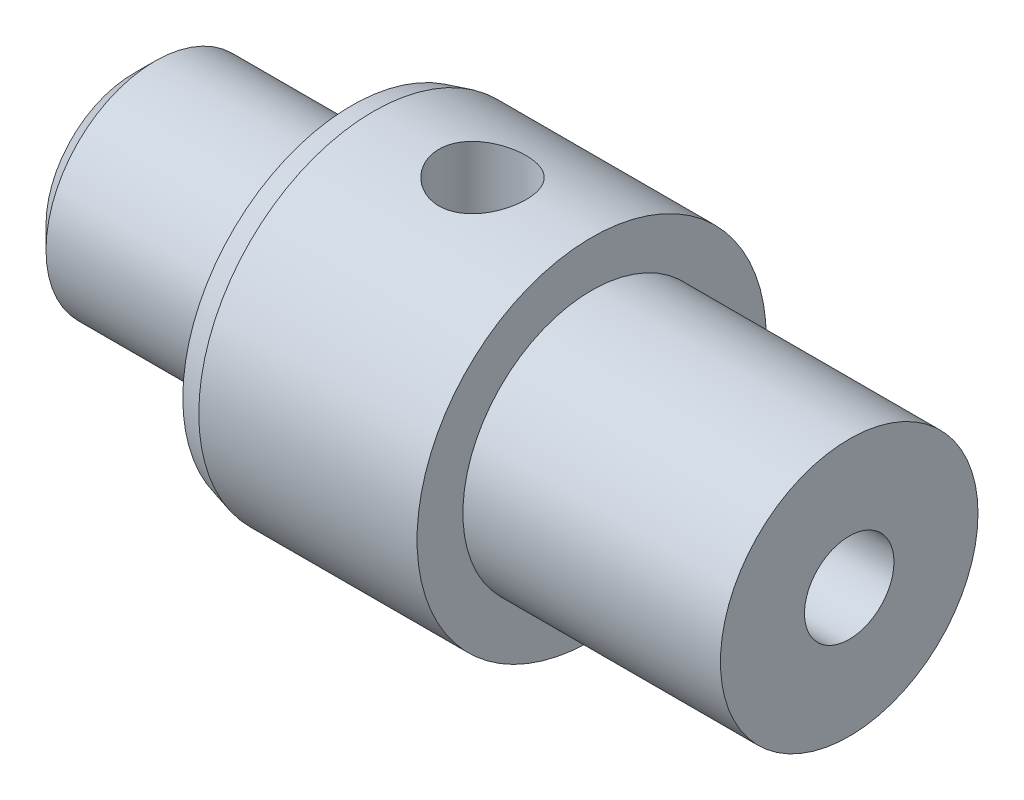
ISO-10303-21;
HEADER;
FILE_DESCRIPTION(('STEP AP214'),'2;1');
FILE_NAME('part.step','',(''),(''),'','','');
FILE_SCHEMA(('AUTOMOTIVE_DESIGN { 1 0 10303 214 1 1 1 1 }'));
ENDSEC;
DATA;
#1=APPLICATION_CONTEXT('core data for automotive mechanical design processes');
#2=APPLICATION_PROTOCOL_DEFINITION('international standard','automotive_design',2000,#1);
#3=PRODUCT_CONTEXT('',#1,'mechanical');
#4=PRODUCT('Part','Part','',(#3));
#5=PRODUCT_RELATED_PRODUCT_CATEGORY('part','',(#4));
#6=PRODUCT_DEFINITION_FORMATION('','',#4);
#7=PRODUCT_DEFINITION_CONTEXT('part definition',#1,'design');
#8=PRODUCT_DEFINITION('design','',#6,#7);
#9=PRODUCT_DEFINITION_SHAPE('','',#8);
#10=(LENGTH_UNIT() NAMED_UNIT(*) SI_UNIT(.MILLI.,.METRE.));
#11=(NAMED_UNIT(*) PLANE_ANGLE_UNIT() SI_UNIT($,.RADIAN.));
#12=(NAMED_UNIT(*) SI_UNIT($,.STERADIAN.) SOLID_ANGLE_UNIT());
#13=UNCERTAINTY_MEASURE_WITH_UNIT(LENGTH_MEASURE(1.E-05),#10,'distance_accuracy_value','');
#14=(GEOMETRIC_REPRESENTATION_CONTEXT(3) GLOBAL_UNCERTAINTY_ASSIGNED_CONTEXT((#13)) GLOBAL_UNIT_ASSIGNED_CONTEXT((#10,
#11,#12)) REPRESENTATION_CONTEXT('',''));
#15=CARTESIAN_POINT('',(0.,0.,0.));
#16=DIRECTION('',(0.,0.,1.));
#17=DIRECTION('',(1.,0.,0.));
#18=AXIS2_PLACEMENT_3D('',#15,#16,#17);
#19=CARTESIAN_POINT('',(10.5,0.,0.));
#20=DIRECTION('',(1.,0.,0.));
#21=DIRECTION('',(0.,0.,-1.));
#22=AXIS2_PLACEMENT_3D('',#19,#20,#21);
#23=PLANE('',#22);
#24=CARTESIAN_POINT('',(10.5,0.,0.));
#25=DIRECTION('',(1.,0.,0.));
#26=DIRECTION('',(0.,0.,-1.));
#27=AXIS2_PLACEMENT_3D('',#24,#25,#26);
#28=CIRCLE('',#27,4.);
#29=CARTESIAN_POINT('',(10.5,0.,-4.));
#30=VERTEX_POINT('',#29);
#31=EDGE_CURVE('E69',#30,#30,#28,.T.);
#32=ORIENTED_EDGE('',*,*,#31,.T.);
#33=EDGE_LOOP('',(#32));
#34=FACE_BOUND('',#33,.T.);
#35=CARTESIAN_POINT('',(10.5,0.,0.));
#36=DIRECTION('',(1.,0.,0.));
#37=DIRECTION('',(0.,0.,-1.));
#38=AXIS2_PLACEMENT_3D('',#35,#36,#37);
#39=CIRCLE('',#38,2.95);
#40=CARTESIAN_POINT('',(10.5,0.,-2.95));
#41=VERTEX_POINT('',#40);
#42=EDGE_CURVE('E55',#41,#41,#39,.T.);
#43=ORIENTED_EDGE('',*,*,#42,.F.);
#44=EDGE_LOOP('',(#43));
#45=FACE_BOUND('',#44,.T.);
#46=ADVANCED_FACE('F35',(#34,#45),#23,.T.);
#47=CARTESIAN_POINT('',(5.,4.,0.));
#48=DIRECTION('',(-1.,0.,0.));
#49=DIRECTION('',(0.,0.,1.));
#50=AXIS2_PLACEMENT_3D('',#47,#48,#49);
#51=PLANE('',#50);
#52=CARTESIAN_POINT('',(5.,0.,0.));
#53=DIRECTION('',(-1.,0.,0.));
#54=DIRECTION('',(0.,0.,1.));
#55=AXIS2_PLACEMENT_3D('',#52,#53,#54);
#56=CIRCLE('',#55,3.86602540400003);
#57=CARTESIAN_POINT('',(5.,0.,3.86602540400003));
#58=VERTEX_POINT('',#57);
#59=EDGE_CURVE('E11',#58,#58,#56,.T.);
#60=ORIENTED_EDGE('',*,*,#59,.T.);
#61=EDGE_LOOP('',(#60));
#62=FACE_BOUND('',#61,.T.);
#63=CARTESIAN_POINT('',(5.,0.,0.));
#64=DIRECTION('',(-1.,0.,0.));
#65=DIRECTION('',(0.,0.,1.));
#66=AXIS2_PLACEMENT_3D('',#63,#64,#65);
#67=CIRCLE('',#66,2.5);
#68=CARTESIAN_POINT('',(5.,0.,2.5));
#69=VERTEX_POINT('',#68);
#70=EDGE_CURVE('E65',#69,#69,#67,.T.);
#71=ORIENTED_EDGE('',*,*,#70,.F.);
#72=EDGE_LOOP('',(#71));
#73=FACE_BOUND('',#72,.T.);
#74=ADVANCED_FACE('F109',(#62,#73),#51,.T.);
#75=CARTESIAN_POINT('',(5.,0.,0.));
#76=DIRECTION('',(1.,0.,0.));
#77=DIRECTION('',(0.,0.,-1.));
#78=AXIS2_PLACEMENT_3D('',#75,#76,#77);
#79=CYLINDRICAL_SURFACE('',#78,4.);
#80=CARTESIAN_POINT('',(5.49999999999986,0.,0.));
#81=DIRECTION('',(-1.,0.,0.));
#82=DIRECTION('',(0.,0.,1.));
#83=AXIS2_PLACEMENT_3D('',#80,#81,#82);
#84=CIRCLE('',#83,4.);
#85=CARTESIAN_POINT('',(5.49999999999986,0.,4.));
#86=VERTEX_POINT('',#85);
#87=EDGE_CURVE('E42',#86,#86,#84,.F.);
#88=ORIENTED_EDGE('',*,*,#87,.T.);
#89=EDGE_LOOP('',(#88));
#90=FACE_BOUND('',#89,.T.);
#91=CARTESIAN_POINT('',(8.99999999999999,4.00000000000001,0.));
#92=CARTESIAN_POINT('',(8.99999844950788,3.99999906578676,-0.05525072577982));
#93=CARTESIAN_POINT('',(8.99540563281746,3.99884385421219,-0.110518771887174));
#94=CARTESIAN_POINT('',(8.97718323246199,3.99434742553261,-0.219470882513686));
#95=CARTESIAN_POINT('',(8.96354852697476,3.99100496946646,-0.273154031247156));
#96=CARTESIAN_POINT('',(8.9277071643586,3.98250417554693,-0.377347248121714));
#97=CARTESIAN_POINT('',(8.90551080085647,3.97734801894725,-0.427861042286664));
#98=CARTESIAN_POINT('',(8.85321240663677,3.96576895871729,-0.524448087936278));
#99=CARTESIAN_POINT('',(8.82311010925403,3.95934601236034,-0.570521189565833));
#100=CARTESIAN_POINT('',(8.75519947356385,3.94578275727868,-0.657867951533939));
#101=CARTESIAN_POINT('',(8.7172589500272,3.93863138099022,-0.699037126707374));
#102=CARTESIAN_POINT('',(8.63503186339405,3.92449080078353,-0.774499284802194));
#103=CARTESIAN_POINT('',(8.59074458470233,3.91750161525566,-0.808791491299414));
#104=CARTESIAN_POINT('',(8.4962698488417,3.9043651713314,-0.870017695199344));
#105=CARTESIAN_POINT('',(8.44600451279306,3.89823196313737,-0.896834810616894));
#106=CARTESIAN_POINT('',(8.34150105889442,3.88766329874816,-0.941597939033674));
#107=CARTESIAN_POINT('',(8.28726357778282,3.88322757115193,-0.959545370292877));
#108=CARTESIAN_POINT('',(8.17750433453168,3.87666984478368,-0.985703224536181));
#109=CARTESIAN_POINT('',(8.12203006930013,3.87450327383618,-0.994101512222213));
#110=CARTESIAN_POINT('',(8.01042095399068,3.87259575025161,-1.00150785004522));
#111=CARTESIAN_POINT('',(7.95428621286759,3.87285440299096,-1.00051742787864));
#112=CARTESIAN_POINT('',(7.84438946150368,3.87572803664412,-0.989324349759508));
#113=CARTESIAN_POINT('',(7.79060291902327,3.87828575334586,-0.979345560127001));
#114=CARTESIAN_POINT('',(7.68549263272581,3.88537806450989,-0.950816124602059));
#115=CARTESIAN_POINT('',(7.63416906464735,3.88991279980464,-0.932264868046271));
#116=CARTESIAN_POINT('',(7.53484132249863,3.90050075936125,-0.886926318624759));
#117=CARTESIAN_POINT('',(7.48687588547364,3.90656884979614,-0.860057778155264));
#118=CARTESIAN_POINT('',(7.39605419349545,3.91953140564258,-0.79890418400996));
#119=CARTESIAN_POINT('',(7.35319883462184,3.9264260155649,-0.764617832539216));
#120=CARTESIAN_POINT('',(7.27253092287041,3.94050587026521,-0.688442283120803));
#121=CARTESIAN_POINT('',(7.23489700662578,3.94769379651981,-0.646364172110565));
#122=CARTESIAN_POINT('',(7.16718583835741,3.96137310385857,-0.556407945002459));
#123=CARTESIAN_POINT('',(7.13710881715763,3.96786446366277,-0.508529651805289));
#124=CARTESIAN_POINT('',(7.08529960918375,3.97945154729455,-0.408077259120922));
#125=CARTESIAN_POINT('',(7.06359643983039,3.9845424008515,-0.355487595472411));
#126=CARTESIAN_POINT('',(7.0293884628603,3.99271944660946,-0.247250672095252));
#127=CARTESIAN_POINT('',(7.01688189572125,3.99580602226187,-0.191603999433654));
#128=CARTESIAN_POINT('',(7.00169495629412,3.9995699951425,-0.0803599802600163));
#129=CARTESIAN_POINT('',(6.99877131594981,4.00030702338852,-0.0247978133254723));
#130=CARTESIAN_POINT('',(7.00216600137034,3.999458698763,0.0860219165343384));
#131=CARTESIAN_POINT('',(7.00848349519943,3.99787355494564,0.141279506429729));
#132=CARTESIAN_POINT('',(7.02998060559427,3.99259720751571,0.249076179184326));
#133=CARTESIAN_POINT('',(7.04502750898467,3.98893756123874,0.301643412645834));
#134=CARTESIAN_POINT('',(7.08340472268564,3.97992471089423,0.403504861635004));
#135=CARTESIAN_POINT('',(7.10673586954212,3.97457133579928,0.452798746021752));
#136=CARTESIAN_POINT('',(7.16149075258316,3.96262205284207,0.547682089619893));
#137=CARTESIAN_POINT('',(7.19305074159785,3.95600578244621,0.593190294557214));
#138=CARTESIAN_POINT('',(7.26319327253132,3.94229672791613,0.678351075762156));
#139=CARTESIAN_POINT('',(7.30177702641128,3.93520386167803,0.718002639315331));
#140=CARTESIAN_POINT('',(7.38600130722965,3.92112637973848,0.791327045381811));
#141=CARTESIAN_POINT('',(7.43179180200162,3.91414869458187,0.824829245081345));
#142=CARTESIAN_POINT('',(7.52848842297715,3.90128585584826,0.883673839341788));
#143=CARTESIAN_POINT('',(7.57939432197317,3.89540065378018,0.90901659610528));
#144=CARTESIAN_POINT('',(7.68460381494206,3.88545396489777,0.950634280406184));
#145=CARTESIAN_POINT('',(7.73888508556268,3.88138170194604,0.966962931102699));
#146=CARTESIAN_POINT('',(7.84953975859274,3.87551162726789,0.990230439969174));
#147=CARTESIAN_POINT('',(7.90591270068833,3.87371331813291,0.997171351652426));
#148=CARTESIAN_POINT('',(8.01741401590347,3.87263267469305,1.00135906022265));
#149=CARTESIAN_POINT('',(8.07253162341649,3.87327955152176,0.998878598520066));
#150=CARTESIAN_POINT('',(8.18153592577865,3.87685272671895,0.984918185541899));
#151=CARTESIAN_POINT('',(8.23542264534243,3.87977897927905,0.973438415124501));
#152=CARTESIAN_POINT('',(8.34013897271027,3.88754173788482,0.941954212961851));
#153=CARTESIAN_POINT('',(8.39098487016013,3.89236676824206,0.922000936453572));
#154=CARTESIAN_POINT('',(8.48864358847579,3.90338503816553,0.874176609070036));
#155=CARTESIAN_POINT('',(8.53545584879127,3.90957846747182,0.846304460022782));
#156=CARTESIAN_POINT('',(8.62503641933467,3.92283756175675,0.782578499091414));
#157=CARTESIAN_POINT('',(8.66766738228263,3.92992176554505,0.746535441941493));
#158=CARTESIAN_POINT('',(8.74636469653026,3.94405351497524,0.667859580793147));
#159=CARTESIAN_POINT('',(8.78242948674197,3.95110105151373,0.625225214174087));
#160=CARTESIAN_POINT('',(8.84760753904306,3.96451770431775,0.533645057801718));
#161=CARTESIAN_POINT('',(8.87658307578104,3.97087222243912,0.484598948210916));
#162=CARTESIAN_POINT('',(8.92583164196034,3.98203283316746,0.382177373006978));
#163=CARTESIAN_POINT('',(8.94611090709901,3.98684003466521,0.328805042291154));
#164=CARTESIAN_POINT('',(8.97438122021976,3.99365373043694,0.229606835495643));
#165=CARTESIAN_POINT('',(8.98396749536894,3.9960172336846,0.184253447272042));
#166=CARTESIAN_POINT('',(8.99677729574795,3.99919070154632,0.0926040476908534));
#167=CARTESIAN_POINT('',(9.00000129953686,4.00000078300597,0.0463081074950765));
#168=CARTESIAN_POINT('',(8.99999999999999,4.00000000000001,0.));
#169=B_SPLINE_CURVE_WITH_KNOTS('',3,(#91,#92,#93,#94,#95,#96,#97,#98,#99,#100,#101,#102,#103,
#104,#105,#106,#107,#108,#109,#110,#111,#112,#113,#114,#115,#116,#117,#118,#119,#120,#121,#122,
#123,#124,#125,#126,#127,#128,#129,#130,#131,#132,#133,#134,#135,#136,#137,#138,#139,#140,#141,
#142,#143,#144,#145,#146,#147,#148,#149,#150,#151,#152,#153,#154,#155,#156,#157,#158,#159,#160,
#161,#162,#163,#164,#165,#166,#167,#168),.UNSPECIFIED.,.T.,.F.,(4,2,2,2,2,2,2,2,2,2,2,2,2,2,2,2,
2,2,2,2,2,2,2,2,2,2,2,2,2,2,2,2,2,2,2,2,2,2,4),(0.,0.165582474981258,0.331258825175929,
0.496736601524066,0.662219960112878,0.830762902914251,0.999324863867068,1.1703909836387,
1.34142974112911,1.50904196732952,1.67662692075129,1.84014998004677,2.00368468977357,
2.16887018582583,2.33408460557439,2.5040100064601,2.67394059705495,2.84445486006073,
3.01493649125758,3.18105539299514,3.34715934075158,3.51080183009354,3.67446084881523,
3.8410239171023,4.00761575338674,4.17829672802979,4.34897012499667,4.51861503076019,
4.68822282168266,4.85295853599069,5.01769093970683,5.18144267039625,5.34521712091261,
5.51326384273267,5.68135046513605,5.85248123666385,6.02348909214226,6.16228161961425,
6.30106370695352),.UNSPECIFIED.);
#170=CARTESIAN_POINT('',(8.99999999999999,4.00000000000001,0.));
#171=VERTEX_POINT('',#170);
#172=EDGE_CURVE('E79',#171,#171,#169,.T.);
#173=ORIENTED_EDGE('',*,*,#172,.F.);
#174=EDGE_LOOP('',(#173));
#175=FACE_BOUND('',#174,.T.);
#176=CARTESIAN_POINT('',(8.,-3.87298334620742,-0.999999999999988));
#177=CARTESIAN_POINT('',(8.05522030035679,-3.87298440057185,-0.999998431438687));
#178=CARTESIAN_POINT('',(8.11045795943136,-3.87417722499279,-0.995410498208057));
#179=CARTESIAN_POINT('',(8.21934703123261,-3.87880744892249,-0.977209250194434));
#180=CARTESIAN_POINT('',(8.27299750177996,-3.88224615474181,-0.963590682698065));
#181=CARTESIAN_POINT('',(8.37712141528784,-3.89095489813012,-0.927796479849623));
#182=CARTESIAN_POINT('',(8.42759886215775,-3.8962225706936,-0.905631891140932));
#183=CARTESIAN_POINT('',(8.52412434101247,-3.90799276818327,-0.853408456505396));
#184=CARTESIAN_POINT('',(8.57017218483114,-3.91449534553241,-0.823349275424494));
#185=CARTESIAN_POINT('',(8.65754465810584,-3.92816286540368,-0.755483370924507));
#186=CARTESIAN_POINT('',(8.69875744014027,-3.93533839048709,-0.717534755081548));
#187=CARTESIAN_POINT('',(8.77430455774387,-3.94945150206622,-0.63527282564032));
#188=CARTESIAN_POINT('',(8.80863825024862,-3.95638906626692,-0.590958917672131));
#189=CARTESIAN_POINT('',(8.86991018705257,-3.96936166208095,-0.496458080431557));
#190=CARTESIAN_POINT('',(8.89673855526459,-3.975382749602,-0.446197830478036));
#191=CARTESIAN_POINT('',(8.9415238576612,-3.9857232477043,-0.341705273717104));
#192=CARTESIAN_POINT('',(8.95948210076619,-3.99004290933747,-0.287473554316773));
#193=CARTESIAN_POINT('',(8.98565913383143,-3.99641903539262,-0.17774350350166));
#194=CARTESIAN_POINT('',(8.99406785773062,-3.99851957537723,-0.122293087819587));
#195=CARTESIAN_POINT('',(9.00150335171021,-4.00037437642922,-0.0107315277051063));
#196=CARTESIAN_POINT('',(9.00053150888383,-4.00012898438682,0.0453795178152285));
#197=CARTESIAN_POINT('',(8.98937005989993,-3.99735237981413,0.155352247172387));
#198=CARTESIAN_POINT('',(8.97938546997845,-3.99487200936349,0.209236215601067));
#199=CARTESIAN_POINT('',(8.95081149198059,-3.98796334609942,0.314538247413685));
#200=CARTESIAN_POINT('',(8.93222164584902,-3.98353494959376,0.365956179370436));
#201=CARTESIAN_POINT('',(8.88679897172516,-3.97315003880358,0.465406703501803));
#202=CARTESIAN_POINT('',(8.85989318213529,-3.96718007878021,0.5134045097665));
#203=CARTESIAN_POINT('',(8.79865772835349,-3.9543596152386,0.604275622340483));
#204=CARTESIAN_POINT('',(8.76432677257574,-3.94750895860996,0.647148035085499));
#205=CARTESIAN_POINT('',(8.68811650320704,-3.93345485507808,0.727774035084949));
#206=CARTESIAN_POINT('',(8.64605804306088,-3.92624687810367,0.765357679075191));
#207=CARTESIAN_POINT('',(8.55616001058389,-3.91246017406683,0.83297637596301));
#208=CARTESIAN_POINT('',(8.50832016820359,-3.90588147642388,0.863011076046007));
#209=CARTESIAN_POINT('',(8.40788398634041,-3.8940819873266,0.914788129022588));
#210=CARTESIAN_POINT('',(8.35526570787472,-3.88886793490289,0.93648956697048));
#211=CARTESIAN_POINT('',(8.24696581276941,-3.88047456055983,0.970685620636329));
#212=CARTESIAN_POINT('',(8.19128485440674,-3.87729480324088,0.983182206552898));
#213=CARTESIAN_POINT('',(8.08001619939075,-3.87342142415657,0.998331855466059));
#214=CARTESIAN_POINT('',(8.02446488266814,-3.8726643563746,1.00123618956784));
#215=CARTESIAN_POINT('',(7.91367122536873,-3.87354937392416,0.997806796206206));
#216=CARTESIAN_POINT('',(7.8584288568195,-3.87519123840507,0.991473919139507));
#217=CARTESIAN_POINT('',(7.75075429401812,-3.88062832781824,0.969970185575052));
#218=CARTESIAN_POINT('',(7.69829090937166,-3.8843878809375,0.954945627312686));
#219=CARTESIAN_POINT('',(7.59662741685933,-3.89360287308385,0.916647232668236));
#220=CARTESIAN_POINT('',(7.54742769637787,-3.89905851299446,0.893372419085006));
#221=CARTESIAN_POINT('',(7.45262348885306,-3.91118454837305,0.838708267174611));
#222=CARTESIAN_POINT('',(7.40710846398276,-3.91787667442657,0.80716870153424));
#223=CARTESIAN_POINT('',(7.32192465487947,-3.93166833228687,0.737060292934445));
#224=CARTESIAN_POINT('',(7.28225683333998,-3.93876793091388,0.698490294805429));
#225=CARTESIAN_POINT('',(7.20887558297162,-3.95278961212643,0.614262720984716));
#226=CARTESIAN_POINT('',(7.17533597498048,-3.95970280824734,0.568451952531583));
#227=CARTESIAN_POINT('',(7.11642565321951,-3.97238886645494,0.471702682694667));
#228=CARTESIAN_POINT('',(7.09105451335673,-3.97816178801584,0.420764448957584));
#229=CARTESIAN_POINT('',(7.04942158618884,-3.98788046295326,0.315558201731084));
#230=CARTESIAN_POINT('',(7.03309428624839,-3.99183932008964,0.261317381027876));
#231=CARTESIAN_POINT('',(7.00981586615664,-3.99754117358315,0.150749760318804));
#232=CARTESIAN_POINT('',(7.00286293650439,-3.99928459757363,0.09442336504124));
#233=CARTESIAN_POINT('',(6.99863241042448,-4.00034169408811,-0.0170835264433287));
#234=CARTESIAN_POINT('',(7.00109829090462,-3.99971978880008,-0.0722538269660348));
#235=CARTESIAN_POINT('',(7.01504782729434,-3.99625896457423,-0.18136749641474));
#236=CARTESIAN_POINT('',(7.02653121501312,-3.99342011157094,-0.235310901780886));
#237=CARTESIAN_POINT('',(7.05805221977094,-3.98585432853963,-0.340171035644814));
#238=CARTESIAN_POINT('',(7.07804345331464,-3.98113764502669,-0.391102494581017));
#239=CARTESIAN_POINT('',(7.12597057901934,-3.97031288913382,-0.488917053041465));
#240=CARTESIAN_POINT('',(7.15390747266958,-3.96420464137727,-0.535799641265047));
#241=CARTESIAN_POINT('',(7.21771523399708,-3.95107249681342,-0.625401928423895));
#242=CARTESIAN_POINT('',(7.25376014290738,-3.94403016945647,-0.667994988300581));
#243=CARTESIAN_POINT('',(7.33242285197382,-3.92990649053207,-0.746615020271245));
#244=CARTESIAN_POINT('',(7.37504231609795,-3.92282512952424,-0.78264032506817));
#245=CARTESIAN_POINT('',(7.4666014142013,-3.90927475860683,-0.847762026479231));
#246=CARTESIAN_POINT('',(7.51564412341249,-3.90281963730391,-0.876716619446584));
#247=CARTESIAN_POINT('',(7.61805548992285,-3.8914395555011,-0.925926896615611));
#248=CARTESIAN_POINT('',(7.67142096610729,-3.88651348244815,-0.946188909759546));
#249=CARTESIAN_POINT('',(7.77057701182628,-3.87951908741315,-0.97442252856556));
#250=CARTESIAN_POINT('',(7.81589316438236,-3.87708663005762,-0.983993170595817));
#251=CARTESIAN_POINT('',(7.90746886900147,-3.87381838580358,-0.996782292572807));
#252=CARTESIAN_POINT('',(7.95372834025063,-3.87298246270639,-1.00000131437051));
#253=CARTESIAN_POINT('',(8.,-3.87298334620742,-0.999999999999988));
#254=B_SPLINE_CURVE_WITH_KNOTS('',3,(#176,#177,#178,#179,#180,#181,#182,#183,#184,#185,#186,
#187,#188,#189,#190,#191,#192,#193,#194,#195,#196,#197,#198,#199,#200,#201,#202,#203,#204,#205,
#206,#207,#208,#209,#210,#211,#212,#213,#214,#215,#216,#217,#218,#219,#220,#221,#222,#223,#224,
#225,#226,#227,#228,#229,#230,#231,#232,#233,#234,#235,#236,#237,#238,#239,#240,#241,#242,#243,
#244,#245,#246,#247,#248,#249,#250,#251,#252,#253),.UNSPECIFIED.,.T.,.F.,(4,2,2,2,2,2,2,2,2,2,2,
2,2,2,2,2,2,2,2,2,2,2,2,2,2,2,2,2,2,2,2,2,2,2,2,2,2,2,4),(0.,0.165490976675229,
0.331078296534208,0.496452290829148,0.661833306984651,0.830495816734639,0.9991740858822,
1.17020598555441,1.3412126393511,1.50875500394411,1.67627259462681,1.84007305071851,
2.00388222686187,2.1691714969805,2.33448954183837,2.50428186625036,2.67408212476192,
2.84470572799632,3.0152928004809,3.18137429900958,3.34744050869791,3.51078961999953,
3.67415808564837,3.84073138339933,4.00733207550288,4.17810132382397,4.34886166284091,
4.51836829119041,4.68784219559884,4.85273378447251,5.01762046947061,5.18161950620153,
5.34563922291497,5.51358838629096,5.68158012622471,5.85270590910138,6.02370688542915,
6.16239130867199,6.30106390036075),.UNSPECIFIED.);
#255=CARTESIAN_POINT('',(8.,-3.87298334620742,-0.999999999999988));
#256=VERTEX_POINT('',#255);
#257=EDGE_CURVE('E72',#256,#256,#254,.T.);
#258=ORIENTED_EDGE('',*,*,#257,.F.);
#259=EDGE_LOOP('',(#258));
#260=FACE_BOUND('',#259,.T.);
#261=ORIENTED_EDGE('',*,*,#31,.F.);
#262=EDGE_LOOP('',(#261));
#263=FACE_BOUND('',#262,.T.);
#264=ADVANCED_FACE('F83',(#90,#175,#260,#263),#79,.T.);
#265=CARTESIAN_POINT('',(0.,0.,0.));
#266=DIRECTION('',(1.,0.,0.));
#267=DIRECTION('',(0.,0.,-1.));
#268=AXIS2_PLACEMENT_3D('',#265,#266,#267);
#269=CYLINDRICAL_SURFACE('',#268,2.5);
#270=CARTESIAN_POINT('',(0.500000000000072,0.,0.));
#271=DIRECTION('',(-1.,0.,0.));
#272=DIRECTION('',(0.,0.,1.));
#273=AXIS2_PLACEMENT_3D('',#270,#271,#272);
#274=CIRCLE('',#273,2.5);
#275=CARTESIAN_POINT('',(0.500000000000072,0.,2.5));
#276=VERTEX_POINT('',#275);
#277=EDGE_CURVE('E127',#276,#276,#274,.F.);
#278=ORIENTED_EDGE('',*,*,#277,.T.);
#279=EDGE_LOOP('',(#278));
#280=FACE_BOUND('',#279,.T.);
#281=ORIENTED_EDGE('',*,*,#70,.T.);
#282=EDGE_LOOP('',(#281));
#283=FACE_BOUND('',#282,.T.);
#284=ADVANCED_FACE('F103',(#280,#283),#269,.T.);
#285=CARTESIAN_POINT('',(0.,0.,0.));
#286=DIRECTION('',(-1.,0.,0.));
#287=DIRECTION('',(0.,0.,1.));
#288=AXIS2_PLACEMENT_3D('',#285,#286,#287);
#289=PLANE('',#288);
#290=CARTESIAN_POINT('',(0.,0.,0.));
#291=DIRECTION('',(-1.,0.,0.));
#292=DIRECTION('',(0.,0.,1.));
#293=AXIS2_PLACEMENT_3D('',#290,#291,#292);
#294=CIRCLE('',#293,1.99999999999993);
#295=CARTESIAN_POINT('',(0.,0.,1.99999999999993));
#296=VERTEX_POINT('',#295);
#297=EDGE_CURVE('E129',#296,#296,#294,.T.);
#298=ORIENTED_EDGE('',*,*,#297,.T.);
#299=EDGE_LOOP('',(#298));
#300=FACE_BOUND('',#299,.T.);
#301=ADVANCED_FACE('F99',(#300),#289,.T.);
#302=CARTESIAN_POINT('',(16.4,0.,0.));
#303=DIRECTION('',(-1.,0.,0.));
#304=DIRECTION('',(0.,0.,1.));
#305=AXIS2_PLACEMENT_3D('',#302,#303,#304);
#306=CYLINDRICAL_SURFACE('',#305,2.95);
#307=CARTESIAN_POINT('',(16.4,0.,0.));
#308=DIRECTION('',(1.,0.,0.));
#309=DIRECTION('',(0.,0.,-1.));
#310=AXIS2_PLACEMENT_3D('',#307,#308,#309);
#311=CIRCLE('',#310,2.95);
#312=CARTESIAN_POINT('',(16.4,0.,-2.95));
#313=VERTEX_POINT('',#312);
#314=EDGE_CURVE('E59',#313,#313,#311,.T.);
#315=ORIENTED_EDGE('',*,*,#314,.F.);
#316=EDGE_LOOP('',(#315));
#317=FACE_BOUND('',#316,.T.);
#318=ORIENTED_EDGE('',*,*,#42,.T.);
#319=EDGE_LOOP('',(#318));
#320=FACE_BOUND('',#319,.T.);
#321=ADVANCED_FACE('F95',(#317,#320),#306,.T.);
#322=CARTESIAN_POINT('',(16.4,0.,0.));
#323=DIRECTION('',(1.,0.,0.));
#324=DIRECTION('',(0.,0.,-1.));
#325=AXIS2_PLACEMENT_3D('',#322,#323,#324);
#326=PLANE('',#325);
#327=CARTESIAN_POINT('',(16.4,0.,0.));
#328=DIRECTION('',(1.,0.,0.));
#329=DIRECTION('',(0.,0.,-1.));
#330=AXIS2_PLACEMENT_3D('',#327,#328,#329);
#331=CIRCLE('',#330,1.025);
#332=CARTESIAN_POINT('',(16.4,0.,-1.025));
#333=VERTEX_POINT('',#332);
#334=EDGE_CURVE('E56',#333,#333,#331,.T.);
#335=ORIENTED_EDGE('',*,*,#334,.F.);
#336=EDGE_LOOP('',(#335));
#337=FACE_BOUND('',#336,.T.);
#338=ORIENTED_EDGE('',*,*,#314,.T.);
#339=EDGE_LOOP('',(#338));
#340=FACE_BOUND('',#339,.T.);
#341=ADVANCED_FACE('F89',(#337,#340),#326,.T.);
#342=CARTESIAN_POINT('',(8.,-4.,0.));
#343=DIRECTION('',(0.,-1.,0.));
#344=DIRECTION('',(0.,0.,-1.));
#345=AXIS2_PLACEMENT_3D('',#342,#343,#344);
#346=CYLINDRICAL_SURFACE('',#345,0.999999999999988);
#347=ORIENTED_EDGE('',*,*,#172,.T.);
#348=EDGE_LOOP('',(#347));
#349=FACE_BOUND('',#348,.T.);
#350=ORIENTED_EDGE('',*,*,#257,.T.);
#351=EDGE_LOOP('',(#350));
#352=FACE_BOUND('',#351,.T.);
#353=ADVANCED_FACE('F49',(#349,#352),#346,.F.);
#354=CARTESIAN_POINT('',(10.4,0.,0.));
#355=DIRECTION('',(1.,0.,0.));
#356=DIRECTION('',(0.,0.,-1.));
#357=AXIS2_PLACEMENT_3D('',#354,#355,#356);
#358=CONICAL_SURFACE('',#357,1.025,1.02974425867665);
#359=CARTESIAN_POINT('',(9.78411786549675,0.,0.));
#360=VERTEX_POINT('',#359);
#361=VERTEX_LOOP('',#360);
#362=FACE_BOUND('',#361,.T.);
#363=CARTESIAN_POINT('',(10.4,0.,0.));
#364=DIRECTION('',(1.,0.,0.));
#365=DIRECTION('',(0.,0.,-1.));
#366=AXIS2_PLACEMENT_3D('',#363,#364,#365);
#367=CIRCLE('',#366,1.025);
#368=CARTESIAN_POINT('',(10.4,0.,-1.025));
#369=VERTEX_POINT('',#368);
#370=EDGE_CURVE('E53',#369,#369,#367,.T.);
#371=ORIENTED_EDGE('',*,*,#370,.T.);
#372=EDGE_LOOP('',(#371));
#373=FACE_BOUND('',#372,.T.);
#374=ADVANCED_FACE('F45',(#362,#373),#358,.F.);
#375=CARTESIAN_POINT('',(16.4,0.,0.));
#376=DIRECTION('',(1.,0.,0.));
#377=DIRECTION('',(0.,0.,-1.));
#378=AXIS2_PLACEMENT_3D('',#375,#376,#377);
#379=CYLINDRICAL_SURFACE('',#378,1.025);
#380=ORIENTED_EDGE('',*,*,#370,.F.);
#381=EDGE_LOOP('',(#380));
#382=FACE_BOUND('',#381,.T.);
#383=ORIENTED_EDGE('',*,*,#334,.T.);
#384=EDGE_LOOP('',(#383));
#385=FACE_BOUND('',#384,.T.);
#386=ADVANCED_FACE('F48',(#382,#385),#379,.F.);
#387=CARTESIAN_POINT('',(0.,0.,0.));
#388=DIRECTION('',(1.,0.,0.));
#389=DIRECTION('',(0.,0.,-1.));
#390=AXIS2_PLACEMENT_3D('',#387,#388,#389);
#391=CONICAL_SURFACE('',#390,1.99999999999993,0.785398163397444);
#392=ORIENTED_EDGE('',*,*,#277,.F.);
#393=EDGE_LOOP('',(#392));
#394=FACE_BOUND('',#393,.T.);
#395=ORIENTED_EDGE('',*,*,#297,.F.);
#396=EDGE_LOOP('',(#395));
#397=FACE_BOUND('',#396,.T.);
#398=ADVANCED_FACE('F124',(#394,#397),#391,.T.);
#399=CARTESIAN_POINT('',(5.49999999999986,0.,0.));
#400=DIRECTION('',(1.,0.,0.));
#401=DIRECTION('',(0.,0.,-1.));
#402=AXIS2_PLACEMENT_3D('',#399,#400,#401);
#403=CONICAL_SURFACE('',#402,4.,0.261799387396916);
#404=ORIENTED_EDGE('',*,*,#59,.F.);
#405=EDGE_LOOP('',(#404));
#406=FACE_BOUND('',#405,.T.);
#407=ORIENTED_EDGE('',*,*,#87,.F.);
#408=EDGE_LOOP('',(#407));
#409=FACE_BOUND('',#408,.T.);
#410=ADVANCED_FACE('F37',(#406,#409),#403,.T.);
#411=CLOSED_SHELL('',(#46,#74,#264,#284,#301,#321,#341,#353,#374,#386,#398,#410));
#412=MANIFOLD_SOLID_BREP('B2',#411);
#413=ADVANCED_BREP_SHAPE_REPRESENTATION('',(#18,#412),#14);
#414=SHAPE_DEFINITION_REPRESENTATION(#9,#413);
ENDSEC;
END-ISO-10303-21;
